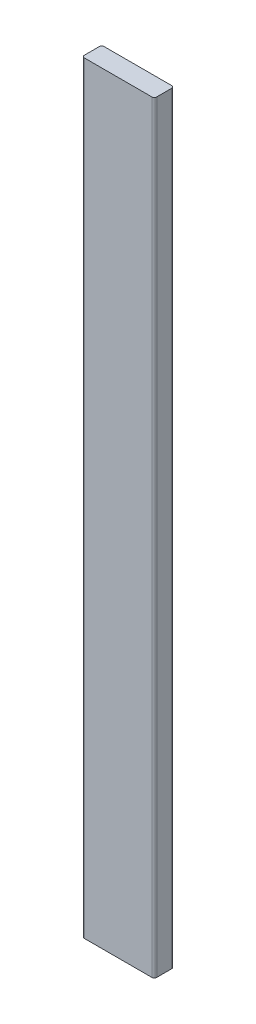
ISO-10303-21;
HEADER;
FILE_DESCRIPTION(('STEP AP214'),'2;1');
FILE_NAME('part.step','',(''),(''),'','','');
FILE_SCHEMA(('AUTOMOTIVE_DESIGN { 1 0 10303 214 1 1 1 1 }'));
ENDSEC;
DATA;
#1=APPLICATION_CONTEXT('core data for automotive mechanical design processes');
#2=APPLICATION_PROTOCOL_DEFINITION('international standard','automotive_design',2000,#1);
#3=PRODUCT_CONTEXT('',#1,'mechanical');
#4=PRODUCT('Part','Part','',(#3));
#5=PRODUCT_RELATED_PRODUCT_CATEGORY('part','',(#4));
#6=PRODUCT_DEFINITION_FORMATION('','',#4);
#7=PRODUCT_DEFINITION_CONTEXT('part definition',#1,'design');
#8=PRODUCT_DEFINITION('design','',#6,#7);
#9=PRODUCT_DEFINITION_SHAPE('','',#8);
#10=(LENGTH_UNIT() NAMED_UNIT(*) SI_UNIT(.MILLI.,.METRE.));
#11=(NAMED_UNIT(*) PLANE_ANGLE_UNIT() SI_UNIT($,.RADIAN.));
#12=(NAMED_UNIT(*) SI_UNIT($,.STERADIAN.) SOLID_ANGLE_UNIT());
#13=UNCERTAINTY_MEASURE_WITH_UNIT(LENGTH_MEASURE(1.E-05),#10,'distance_accuracy_value','');
#14=(GEOMETRIC_REPRESENTATION_CONTEXT(3) GLOBAL_UNCERTAINTY_ASSIGNED_CONTEXT((#13)) GLOBAL_UNIT_ASSIGNED_CONTEXT((#10,
#11,#12)) REPRESENTATION_CONTEXT('',''));
#15=CARTESIAN_POINT('',(0.,0.,0.));
#16=DIRECTION('',(0.,0.,1.));
#17=DIRECTION('',(1.,0.,0.));
#18=AXIS2_PLACEMENT_3D('',#15,#16,#17);
#19=CARTESIAN_POINT('',(-204.932187925,1473.2,-38.0999999999998));
#20=DIRECTION('',(0.,0.,-1.));
#21=DIRECTION('',(0.,-1.,0.));
#22=AXIS2_PLACEMENT_3D('',#19,#20,#21);
#23=PLANE('',#22);
#24=DIRECTION('',(-1.,0.,0.));
#25=VECTOR('',#24,1.);
#26=CARTESIAN_POINT('',(-344.632187925,1473.2,-38.0999999999998));
#27=LINE('',#26,#25);
#28=CARTESIAN_POINT('',(-209.694687925,1473.2,-38.0999999999998));
#29=VERTEX_POINT('',#28);
#30=CARTESIAN_POINT('',(-339.869687925,1473.2,-38.0999999999998));
#31=VERTEX_POINT('',#30);
#32=EDGE_CURVE('E144',#29,#31,#27,.T.);
#33=ORIENTED_EDGE('',*,*,#32,.F.);
#34=DIRECTION('',(0.,1.,0.));
#35=VECTOR('',#34,1.);
#36=CARTESIAN_POINT('',(-209.694687925,1473.2,-38.0999999999998));
#37=LINE('',#36,#35);
#38=CARTESIAN_POINT('',(-209.694687925,0.,-38.0999999999994));
#39=VERTEX_POINT('',#38);
#40=EDGE_CURVE('E11',#29,#39,#37,.F.);
#41=ORIENTED_EDGE('',*,*,#40,.T.);
#42=DIRECTION('',(1.,0.,0.));
#43=VECTOR('',#42,1.);
#44=CARTESIAN_POINT('',(-344.632187925,0.,-38.0999999999994));
#45=LINE('',#44,#43);
#46=CARTESIAN_POINT('',(-339.869687925,0.,-38.0999999999994));
#47=VERTEX_POINT('',#46);
#48=EDGE_CURVE('E137',#47,#39,#45,.T.);
#49=ORIENTED_EDGE('',*,*,#48,.F.);
#50=DIRECTION('',(0.,-1.,0.));
#51=VECTOR('',#50,1.);
#52=CARTESIAN_POINT('',(-339.869687925,1473.2,-38.0999999999998));
#53=LINE('',#52,#51);
#54=EDGE_CURVE('E47',#47,#31,#53,.F.);
#55=ORIENTED_EDGE('',*,*,#54,.T.);
#56=EDGE_LOOP('',(#33,#41,#49,#55));
#57=FACE_BOUND('',#56,.T.);
#58=ADVANCED_FACE('F38',(#57),#23,.T.);
#59=CARTESIAN_POINT('',(0.,0.,0.));
#60=DIRECTION('',(0.,0.,1.));
#61=DIRECTION('',(1.,0.,0.));
#62=AXIS2_PLACEMENT_3D('',#59,#60,#61);
#63=PLANE('',#62);
#64=DIRECTION('',(-1.,0.,0.));
#65=VECTOR('',#64,1.);
#66=CARTESIAN_POINT('',(-344.632187925,1473.2,0.));
#67=LINE('',#66,#65);
#68=CARTESIAN_POINT('',(-209.694687925,1473.2,0.));
#69=VERTEX_POINT('',#68);
#70=CARTESIAN_POINT('',(-339.869687925,1473.2,0.));
#71=VERTEX_POINT('',#70);
#72=EDGE_CURVE('E125',#69,#71,#67,.T.);
#73=ORIENTED_EDGE('',*,*,#72,.T.);
#74=DIRECTION('',(0.,-1.,0.));
#75=VECTOR('',#74,1.);
#76=CARTESIAN_POINT('',(-339.869687925,0.,0.));
#77=LINE('',#76,#75);
#78=CARTESIAN_POINT('',(-339.869687925,0.,0.));
#79=VERTEX_POINT('',#78);
#80=EDGE_CURVE('E107',#71,#79,#77,.T.);
#81=ORIENTED_EDGE('',*,*,#80,.T.);
#82=DIRECTION('',(1.,0.,0.));
#83=VECTOR('',#82,1.);
#84=CARTESIAN_POINT('',(-344.632187925,0.,0.));
#85=LINE('',#84,#83);
#86=CARTESIAN_POINT('',(-209.694687925,0.,0.));
#87=VERTEX_POINT('',#86);
#88=EDGE_CURVE('E122',#79,#87,#85,.T.);
#89=ORIENTED_EDGE('',*,*,#88,.T.);
#90=DIRECTION('',(0.,1.,0.));
#91=VECTOR('',#90,1.);
#92=CARTESIAN_POINT('',(-209.694687925,0.,0.));
#93=LINE('',#92,#91);
#94=EDGE_CURVE('E128',#87,#69,#93,.T.);
#95=ORIENTED_EDGE('',*,*,#94,.T.);
#96=EDGE_LOOP('',(#73,#81,#89,#95));
#97=FACE_BOUND('',#96,.T.);
#98=ADVANCED_FACE('F120',(#97),#63,.T.);
#99=CARTESIAN_POINT('',(-344.632187925,0.,-1517.90888293049));
#100=DIRECTION('',(0.,-1.,0.));
#101=DIRECTION('',(1.,0.,0.));
#102=AXIS2_PLACEMENT_3D('',#99,#100,#101);
#103=PLANE('',#102);
#104=ORIENTED_EDGE('',*,*,#88,.F.);
#105=CARTESIAN_POINT('',(-339.869687925,0.,-4.7625));
#106=DIRECTION('',(0.,-1.,0.));
#107=DIRECTION('',(1.,0.,0.));
#108=AXIS2_PLACEMENT_3D('',#105,#106,#107);
#109=CIRCLE('',#108,4.7625);
#110=CARTESIAN_POINT('',(-344.632187925,0.,-4.7625));
#111=VERTEX_POINT('',#110);
#112=EDGE_CURVE('E103',#79,#111,#109,.T.);
#113=ORIENTED_EDGE('',*,*,#112,.T.);
#114=DIRECTION('',(0.,0.,1.));
#115=VECTOR('',#114,1.);
#116=CARTESIAN_POINT('',(-344.632187925,0.,-1517.90888293049));
#117=LINE('',#116,#115);
#118=CARTESIAN_POINT('',(-344.632187925,0.,-33.3374999999994));
#119=VERTEX_POINT('',#118);
#120=EDGE_CURVE('E152',#119,#111,#117,.T.);
#121=ORIENTED_EDGE('',*,*,#120,.F.);
#122=CARTESIAN_POINT('',(-339.869687925,0.,-33.3374999999995));
#123=DIRECTION('',(0.,-1.,0.));
#124=DIRECTION('',(1.,0.,0.));
#125=AXIS2_PLACEMENT_3D('',#122,#123,#124);
#126=CIRCLE('',#125,4.7625);
#127=EDGE_CURVE('E164',#119,#47,#126,.T.);
#128=ORIENTED_EDGE('',*,*,#127,.T.);
#129=ORIENTED_EDGE('',*,*,#48,.T.);
#130=CARTESIAN_POINT('',(-209.694687925,0.,-33.3374999999995));
#131=DIRECTION('',(0.,-1.,0.));
#132=DIRECTION('',(1.,0.,0.));
#133=AXIS2_PLACEMENT_3D('',#130,#131,#132);
#134=CIRCLE('',#133,4.7625);
#135=CARTESIAN_POINT('',(-204.932187925,0.,-33.3374999999994));
#136=VERTEX_POINT('',#135);
#137=EDGE_CURVE('E115',#39,#136,#134,.T.);
#138=ORIENTED_EDGE('',*,*,#137,.T.);
#139=DIRECTION('',(0.,0.,1.));
#140=VECTOR('',#139,1.);
#141=CARTESIAN_POINT('',(-204.932187925,0.,-1517.90888293049));
#142=LINE('',#141,#140);
#143=CARTESIAN_POINT('',(-204.932187925,0.,-4.7625));
#144=VERTEX_POINT('',#143);
#145=EDGE_CURVE('E143',#136,#144,#142,.T.);
#146=ORIENTED_EDGE('',*,*,#145,.T.);
#147=CARTESIAN_POINT('',(-209.694687925,0.,-4.7625));
#148=DIRECTION('',(0.,-1.,0.));
#149=DIRECTION('',(1.,0.,0.));
#150=AXIS2_PLACEMENT_3D('',#147,#148,#149);
#151=CIRCLE('',#150,4.7625);
#152=EDGE_CURVE('E127',#144,#87,#151,.T.);
#153=ORIENTED_EDGE('',*,*,#152,.T.);
#154=EDGE_LOOP('',(#104,#113,#121,#128,#129,#138,#146,#153));
#155=FACE_BOUND('',#154,.T.);
#156=ADVANCED_FACE('F130',(#155),#103,.T.);
#157=CARTESIAN_POINT('',(-204.932187925,1473.2,-1517.90888293049));
#158=DIRECTION('',(1.,0.,0.));
#159=DIRECTION('',(0.,1.,0.));
#160=AXIS2_PLACEMENT_3D('',#157,#158,#159);
#161=PLANE('',#160);
#162=ORIENTED_EDGE('',*,*,#145,.F.);
#163=DIRECTION('',(0.,1.,0.));
#164=VECTOR('',#163,1.);
#165=CARTESIAN_POINT('',(-204.932187925,1473.2,-33.3374999999998));
#166=LINE('',#165,#164);
#167=CARTESIAN_POINT('',(-204.932187925,1473.2,-33.3374999999998));
#168=VERTEX_POINT('',#167);
#169=EDGE_CURVE('E188',#136,#168,#166,.T.);
#170=ORIENTED_EDGE('',*,*,#169,.T.);
#171=DIRECTION('',(0.,0.,1.));
#172=VECTOR('',#171,1.);
#173=CARTESIAN_POINT('',(-204.932187925,1473.2,-1517.90888293049));
#174=LINE('',#173,#172);
#175=CARTESIAN_POINT('',(-204.932187925,1473.2,-4.7625));
#176=VERTEX_POINT('',#175);
#177=EDGE_CURVE('E148',#168,#176,#174,.T.);
#178=ORIENTED_EDGE('',*,*,#177,.T.);
#179=DIRECTION('',(0.,1.,0.));
#180=VECTOR('',#179,1.);
#181=CARTESIAN_POINT('',(-204.932187925,1473.2,-4.7625));
#182=LINE('',#181,#180);
#183=EDGE_CURVE('E185',#176,#144,#182,.F.);
#184=ORIENTED_EDGE('',*,*,#183,.T.);
#185=EDGE_LOOP('',(#162,#170,#178,#184));
#186=FACE_BOUND('',#185,.T.);
#187=ADVANCED_FACE('F218',(#186),#161,.T.);
#188=CARTESIAN_POINT('',(-344.632187925,1473.2,-1517.90888293049));
#189=DIRECTION('',(0.,1.,0.));
#190=DIRECTION('',(0.,0.,1.));
#191=AXIS2_PLACEMENT_3D('',#188,#189,#190);
#192=PLANE('',#191);
#193=DIRECTION('',(0.,0.,1.));
#194=VECTOR('',#193,1.);
#195=CARTESIAN_POINT('',(-344.632187925,1473.2,-1517.90888293049));
#196=LINE('',#195,#194);
#197=CARTESIAN_POINT('',(-344.632187925,1473.2,-33.3374999999998));
#198=VERTEX_POINT('',#197);
#199=CARTESIAN_POINT('',(-344.632187925,1473.2,-4.7625));
#200=VERTEX_POINT('',#199);
#201=EDGE_CURVE('E147',#198,#200,#196,.T.);
#202=ORIENTED_EDGE('',*,*,#201,.T.);
#203=CARTESIAN_POINT('',(-339.869687925,1473.2,-4.7625));
#204=DIRECTION('',(0.,1.,0.));
#205=DIRECTION('',(0.,0.,1.));
#206=AXIS2_PLACEMENT_3D('',#203,#204,#205);
#207=CIRCLE('',#206,4.7625);
#208=EDGE_CURVE('E182',#200,#71,#207,.T.);
#209=ORIENTED_EDGE('',*,*,#208,.T.);
#210=ORIENTED_EDGE('',*,*,#72,.F.);
#211=CARTESIAN_POINT('',(-209.694687925,1473.2,-4.7625));
#212=DIRECTION('',(0.,1.,0.));
#213=DIRECTION('',(0.,0.,1.));
#214=AXIS2_PLACEMENT_3D('',#211,#212,#213);
#215=CIRCLE('',#214,4.7625);
#216=EDGE_CURVE('E174',#69,#176,#215,.T.);
#217=ORIENTED_EDGE('',*,*,#216,.T.);
#218=ORIENTED_EDGE('',*,*,#177,.F.);
#219=CARTESIAN_POINT('',(-209.694687925,1473.2,-33.3374999999998));
#220=DIRECTION('',(0.,1.,0.));
#221=DIRECTION('',(0.,0.,1.));
#222=AXIS2_PLACEMENT_3D('',#219,#220,#221);
#223=CIRCLE('',#222,4.7625);
#224=EDGE_CURVE('E60',#168,#29,#223,.T.);
#225=ORIENTED_EDGE('',*,*,#224,.T.);
#226=ORIENTED_EDGE('',*,*,#32,.T.);
#227=CARTESIAN_POINT('',(-339.869687925,1473.2,-33.3374999999998));
#228=DIRECTION('',(0.,1.,0.));
#229=DIRECTION('',(0.,0.,1.));
#230=AXIS2_PLACEMENT_3D('',#227,#228,#229);
#231=CIRCLE('',#230,4.7625);
#232=EDGE_CURVE('E177',#31,#198,#231,.T.);
#233=ORIENTED_EDGE('',*,*,#232,.T.);
#234=EDGE_LOOP('',(#202,#209,#210,#217,#218,#225,#226,#233));
#235=FACE_BOUND('',#234,.T.);
#236=ADVANCED_FACE('F222',(#235),#192,.T.);
#237=CARTESIAN_POINT('',(-344.632187925,1473.2,-1517.90888293049));
#238=DIRECTION('',(-1.,0.,0.));
#239=DIRECTION('',(0.,-1.,0.));
#240=AXIS2_PLACEMENT_3D('',#237,#238,#239);
#241=PLANE('',#240);
#242=ORIENTED_EDGE('',*,*,#120,.T.);
#243=DIRECTION('',(0.,-1.,0.));
#244=VECTOR('',#243,1.);
#245=CARTESIAN_POINT('',(-344.632187925,1473.2,-4.7625));
#246=LINE('',#245,#244);
#247=EDGE_CURVE('E108',#111,#200,#246,.F.);
#248=ORIENTED_EDGE('',*,*,#247,.T.);
#249=ORIENTED_EDGE('',*,*,#201,.F.);
#250=DIRECTION('',(0.,-1.,0.));
#251=VECTOR('',#250,1.);
#252=CARTESIAN_POINT('',(-344.632187925,1473.2,-33.3374999999998));
#253=LINE('',#252,#251);
#254=EDGE_CURVE('E114',#198,#119,#253,.T.);
#255=ORIENTED_EDGE('',*,*,#254,.T.);
#256=EDGE_LOOP('',(#242,#248,#249,#255));
#257=FACE_BOUND('',#256,.T.);
#258=ADVANCED_FACE('F232',(#257),#241,.T.);
#259=CARTESIAN_POINT('',(-339.869687925,0.,-4.7625));
#260=DIRECTION('',(0.,-1.,0.));
#261=DIRECTION('',(1.,0.,0.));
#262=AXIS2_PLACEMENT_3D('',#259,#260,#261);
#263=CYLINDRICAL_SURFACE('',#262,4.7625);
#264=ORIENTED_EDGE('',*,*,#208,.F.);
#265=ORIENTED_EDGE('',*,*,#247,.F.);
#266=ORIENTED_EDGE('',*,*,#112,.F.);
#267=ORIENTED_EDGE('',*,*,#80,.F.);
#268=EDGE_LOOP('',(#264,#265,#266,#267));
#269=FACE_BOUND('',#268,.T.);
#270=ADVANCED_FACE('F106',(#269),#263,.T.);
#271=CARTESIAN_POINT('',(-209.694687925,1473.2,-33.3374999999998));
#272=DIRECTION('',(0.,1.,0.));
#273=DIRECTION('',(0.,0.,1.));
#274=AXIS2_PLACEMENT_3D('',#271,#272,#273);
#275=CYLINDRICAL_SURFACE('',#274,4.7625);
#276=ORIENTED_EDGE('',*,*,#137,.F.);
#277=ORIENTED_EDGE('',*,*,#40,.F.);
#278=ORIENTED_EDGE('',*,*,#224,.F.);
#279=ORIENTED_EDGE('',*,*,#169,.F.);
#280=EDGE_LOOP('',(#276,#277,#278,#279));
#281=FACE_BOUND('',#280,.T.);
#282=ADVANCED_FACE('F225',(#281),#275,.T.);
#283=CARTESIAN_POINT('',(-339.869687925,1473.2,-33.3374999999998));
#284=DIRECTION('',(0.,-1.,0.));
#285=DIRECTION('',(0.,0.,-1.));
#286=AXIS2_PLACEMENT_3D('',#283,#284,#285);
#287=CYLINDRICAL_SURFACE('',#286,4.7625);
#288=ORIENTED_EDGE('',*,*,#232,.F.);
#289=ORIENTED_EDGE('',*,*,#54,.F.);
#290=ORIENTED_EDGE('',*,*,#127,.F.);
#291=ORIENTED_EDGE('',*,*,#254,.F.);
#292=EDGE_LOOP('',(#288,#289,#290,#291));
#293=FACE_BOUND('',#292,.T.);
#294=ADVANCED_FACE('F230',(#293),#287,.T.);
#295=CARTESIAN_POINT('',(-209.694687925,0.,-4.7625));
#296=DIRECTION('',(0.,1.,0.));
#297=DIRECTION('',(-1.,0.,0.));
#298=AXIS2_PLACEMENT_3D('',#295,#296,#297);
#299=CYLINDRICAL_SURFACE('',#298,4.7625);
#300=ORIENTED_EDGE('',*,*,#152,.F.);
#301=ORIENTED_EDGE('',*,*,#183,.F.);
#302=ORIENTED_EDGE('',*,*,#216,.F.);
#303=ORIENTED_EDGE('',*,*,#94,.F.);
#304=EDGE_LOOP('',(#300,#301,#302,#303));
#305=FACE_BOUND('',#304,.T.);
#306=ADVANCED_FACE('F40',(#305),#299,.T.);
#307=CLOSED_SHELL('',(#58,#98,#156,#187,#236,#258,#270,#282,#294,#306));
#308=MANIFOLD_SOLID_BREP('B2',#307);
#309=ADVANCED_BREP_SHAPE_REPRESENTATION('',(#18,#308),#14);
#310=SHAPE_DEFINITION_REPRESENTATION(#9,#309);
ENDSEC;
END-ISO-10303-21;
